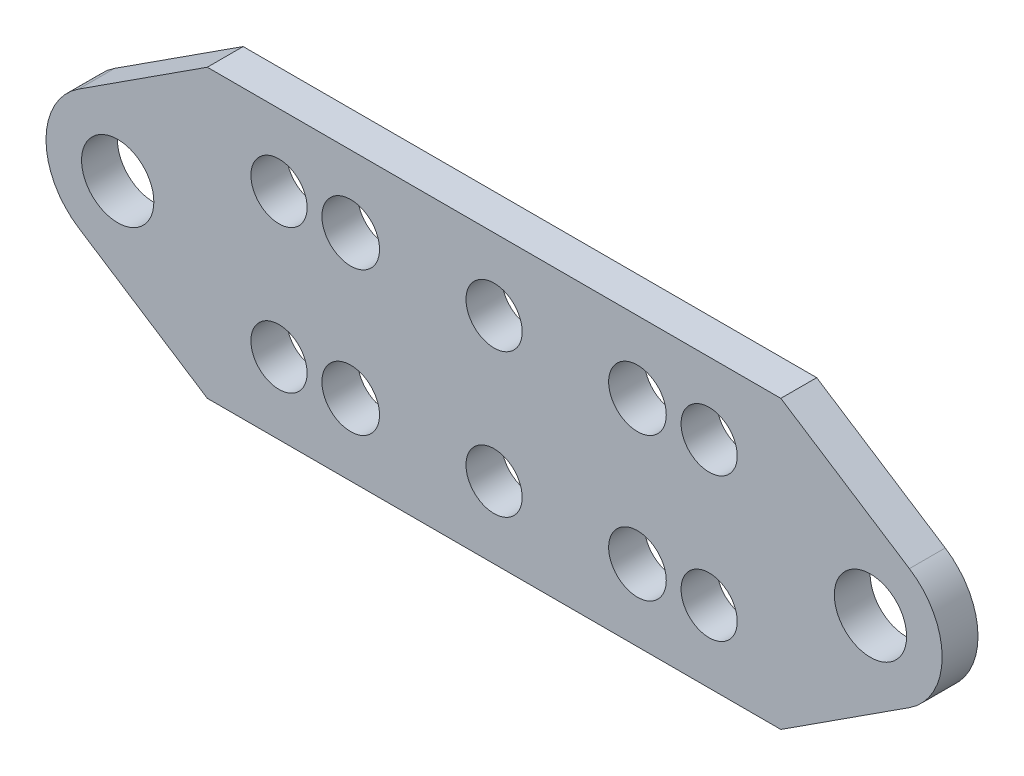
ISO-10303-21;
HEADER;
FILE_DESCRIPTION(('STEP AP214'),'2;1');
FILE_NAME('part.step','',(''),(''),'','','');
FILE_SCHEMA(('AUTOMOTIVE_DESIGN { 1 0 10303 214 1 1 1 1 }'));
ENDSEC;
DATA;
#1=APPLICATION_CONTEXT('core data for automotive mechanical design processes');
#2=APPLICATION_PROTOCOL_DEFINITION('international standard','automotive_design',2000,#1);
#3=PRODUCT_CONTEXT('',#1,'mechanical');
#4=PRODUCT('Part','Part','',(#3));
#5=PRODUCT_RELATED_PRODUCT_CATEGORY('part','',(#4));
#6=PRODUCT_DEFINITION_FORMATION('','',#4);
#7=PRODUCT_DEFINITION_CONTEXT('part definition',#1,'design');
#8=PRODUCT_DEFINITION('design','',#6,#7);
#9=PRODUCT_DEFINITION_SHAPE('','',#8);
#10=(LENGTH_UNIT() NAMED_UNIT(*) SI_UNIT(.MILLI.,.METRE.));
#11=(NAMED_UNIT(*) PLANE_ANGLE_UNIT() SI_UNIT($,.RADIAN.));
#12=(NAMED_UNIT(*) SI_UNIT($,.STERADIAN.) SOLID_ANGLE_UNIT());
#13=UNCERTAINTY_MEASURE_WITH_UNIT(LENGTH_MEASURE(1.E-05),#10,'distance_accuracy_value','');
#14=(GEOMETRIC_REPRESENTATION_CONTEXT(3) GLOBAL_UNCERTAINTY_ASSIGNED_CONTEXT((#13)) GLOBAL_UNIT_ASSIGNED_CONTEXT((#10,
#11,#12)) REPRESENTATION_CONTEXT('',''));
#15=CARTESIAN_POINT('',(0.,0.,0.));
#16=DIRECTION('',(0.,0.,1.));
#17=DIRECTION('',(1.,0.,0.));
#18=AXIS2_PLACEMENT_3D('',#15,#16,#17);
#19=CARTESIAN_POINT('',(-29.0438840042581,0.,0.));
#20=DIRECTION('',(0.,0.,1.));
#21=DIRECTION('',(1.,0.,0.));
#22=AXIS2_PLACEMENT_3D('',#19,#20,#21);
#23=PLANE('',#22);
#24=CARTESIAN_POINT('',(33.3375,0.,0.));
#25=DIRECTION('',(0.,0.,1.));
#26=DIRECTION('',(1.,0.,0.));
#27=AXIS2_PLACEMENT_3D('',#24,#25,#26);
#28=CIRCLE('',#27,3.2004);
#29=CARTESIAN_POINT('',(36.5379,0.,0.));
#30=VERTEX_POINT('',#29);
#31=EDGE_CURVE('E179',#30,#30,#28,.T.);
#32=ORIENTED_EDGE('',*,*,#31,.T.);
#33=EDGE_LOOP('',(#32));
#34=FACE_BOUND('',#33,.T.);
#35=CARTESIAN_POINT('',(-33.3375,0.,0.));
#36=DIRECTION('',(0.,0.,1.));
#37=DIRECTION('',(1.,0.,0.));
#38=AXIS2_PLACEMENT_3D('',#35,#36,#37);
#39=CIRCLE('',#38,3.2004);
#40=CARTESIAN_POINT('',(-30.1371,0.,0.));
#41=VERTEX_POINT('',#40);
#42=EDGE_CURVE('E182',#41,#41,#39,.T.);
#43=ORIENTED_EDGE('',*,*,#42,.T.);
#44=EDGE_LOOP('',(#43));
#45=FACE_BOUND('',#44,.T.);
#46=CARTESIAN_POINT('',(19.05,-6.35,0.));
#47=DIRECTION('',(0.,0.,1.));
#48=DIRECTION('',(1.,0.,0.));
#49=AXIS2_PLACEMENT_3D('',#46,#47,#48);
#50=CIRCLE('',#49,2.4892);
#51=CARTESIAN_POINT('',(21.5392,-6.35,0.));
#52=VERTEX_POINT('',#51);
#53=EDGE_CURVE('E185',#52,#52,#50,.T.);
#54=ORIENTED_EDGE('',*,*,#53,.T.);
#55=EDGE_LOOP('',(#54));
#56=FACE_BOUND('',#55,.T.);
#57=CARTESIAN_POINT('',(0.,-6.35,0.));
#58=DIRECTION('',(0.,0.,1.));
#59=DIRECTION('',(1.,0.,0.));
#60=AXIS2_PLACEMENT_3D('',#57,#58,#59);
#61=CIRCLE('',#60,2.4892);
#62=CARTESIAN_POINT('',(2.4892,-6.35,0.));
#63=VERTEX_POINT('',#62);
#64=EDGE_CURVE('E188',#63,#63,#61,.T.);
#65=ORIENTED_EDGE('',*,*,#64,.T.);
#66=EDGE_LOOP('',(#65));
#67=FACE_BOUND('',#66,.T.);
#68=CARTESIAN_POINT('',(-19.05,-6.35,0.));
#69=DIRECTION('',(0.,0.,1.));
#70=DIRECTION('',(1.,0.,0.));
#71=AXIS2_PLACEMENT_3D('',#68,#69,#70);
#72=CIRCLE('',#71,2.4892);
#73=CARTESIAN_POINT('',(-16.5608,-6.35,0.));
#74=VERTEX_POINT('',#73);
#75=EDGE_CURVE('E191',#74,#74,#72,.T.);
#76=ORIENTED_EDGE('',*,*,#75,.T.);
#77=EDGE_LOOP('',(#76));
#78=FACE_BOUND('',#77,.T.);
#79=CARTESIAN_POINT('',(-19.05,6.35,0.));
#80=DIRECTION('',(0.,0.,1.));
#81=DIRECTION('',(1.,0.,0.));
#82=AXIS2_PLACEMENT_3D('',#79,#80,#81);
#83=CIRCLE('',#82,2.4892);
#84=CARTESIAN_POINT('',(-16.5608,6.35,0.));
#85=VERTEX_POINT('',#84);
#86=EDGE_CURVE('E194',#85,#85,#83,.T.);
#87=ORIENTED_EDGE('',*,*,#86,.T.);
#88=EDGE_LOOP('',(#87));
#89=FACE_BOUND('',#88,.T.);
#90=CARTESIAN_POINT('',(0.,6.35,0.));
#91=DIRECTION('',(0.,0.,1.));
#92=DIRECTION('',(1.,0.,0.));
#93=AXIS2_PLACEMENT_3D('',#90,#91,#92);
#94=CIRCLE('',#93,2.4892);
#95=CARTESIAN_POINT('',(2.4892,6.35,0.));
#96=VERTEX_POINT('',#95);
#97=EDGE_CURVE('E197',#96,#96,#94,.T.);
#98=ORIENTED_EDGE('',*,*,#97,.T.);
#99=EDGE_LOOP('',(#98));
#100=FACE_BOUND('',#99,.T.);
#101=CARTESIAN_POINT('',(19.05,6.35,0.));
#102=DIRECTION('',(0.,0.,1.));
#103=DIRECTION('',(1.,0.,0.));
#104=AXIS2_PLACEMENT_3D('',#101,#102,#103);
#105=CIRCLE('',#104,2.4892);
#106=CARTESIAN_POINT('',(21.5392,6.35,0.));
#107=VERTEX_POINT('',#106);
#108=EDGE_CURVE('E200',#107,#107,#105,.T.);
#109=ORIENTED_EDGE('',*,*,#108,.T.);
#110=EDGE_LOOP('',(#109));
#111=FACE_BOUND('',#110,.T.);
#112=CARTESIAN_POINT('',(12.7,6.35,0.));
#113=DIRECTION('',(0.,0.,1.));
#114=DIRECTION('',(1.,0.,0.));
#115=AXIS2_PLACEMENT_3D('',#112,#113,#114);
#116=CIRCLE('',#115,2.5527);
#117=CARTESIAN_POINT('',(15.2527,6.35,0.));
#118=VERTEX_POINT('',#117);
#119=EDGE_CURVE('E203',#118,#118,#116,.T.);
#120=ORIENTED_EDGE('',*,*,#119,.T.);
#121=EDGE_LOOP('',(#120));
#122=FACE_BOUND('',#121,.T.);
#123=CARTESIAN_POINT('',(-12.7,-6.35,0.));
#124=DIRECTION('',(0.,0.,1.));
#125=DIRECTION('',(1.,0.,0.));
#126=AXIS2_PLACEMENT_3D('',#123,#124,#125);
#127=CIRCLE('',#126,2.5527);
#128=CARTESIAN_POINT('',(-10.1473,-6.35,0.));
#129=VERTEX_POINT('',#128);
#130=EDGE_CURVE('E206',#129,#129,#127,.T.);
#131=ORIENTED_EDGE('',*,*,#130,.T.);
#132=EDGE_LOOP('',(#131));
#133=FACE_BOUND('',#132,.T.);
#134=CARTESIAN_POINT('',(-12.7,6.35,0.));
#135=DIRECTION('',(0.,0.,1.));
#136=DIRECTION('',(1.,0.,0.));
#137=AXIS2_PLACEMENT_3D('',#134,#135,#136);
#138=CIRCLE('',#137,2.5527);
#139=CARTESIAN_POINT('',(-10.1473,6.35,0.));
#140=VERTEX_POINT('',#139);
#141=EDGE_CURVE('E209',#140,#140,#138,.T.);
#142=ORIENTED_EDGE('',*,*,#141,.T.);
#143=EDGE_LOOP('',(#142));
#144=FACE_BOUND('',#143,.T.);
#145=CARTESIAN_POINT('',(12.7,-6.35,0.));
#146=DIRECTION('',(0.,0.,1.));
#147=DIRECTION('',(1.,0.,0.));
#148=AXIS2_PLACEMENT_3D('',#145,#146,#147);
#149=CIRCLE('',#148,2.5527);
#150=CARTESIAN_POINT('',(15.2527,-6.35,0.));
#151=VERTEX_POINT('',#150);
#152=EDGE_CURVE('E212',#151,#151,#149,.T.);
#153=ORIENTED_EDGE('',*,*,#152,.T.);
#154=EDGE_LOOP('',(#153));
#155=FACE_BOUND('',#154,.T.);
#156=CARTESIAN_POINT('',(-33.3375,0.,0.));
#157=DIRECTION('',(0.,0.,1.));
#158=DIRECTION('',(1.,0.,0.));
#159=AXIS2_PLACEMENT_3D('',#156,#157,#158);
#160=CIRCLE('',#159,6.35);
#161=CARTESIAN_POINT('',(-36.7873358456419,5.3311474035262,0.));
#162=VERTEX_POINT('',#161);
#163=CARTESIAN_POINT('',(-36.7873358456419,-5.33114740352621,0.));
#164=VERTEX_POINT('',#163);
#165=EDGE_CURVE('E19',#162,#164,#160,.T.);
#166=ORIENTED_EDGE('',*,*,#165,.F.);
#167=DIRECTION('',(-0.83955077220885,-0.54328123553416,0.));
#168=VECTOR('',#167,1.);
#169=CARTESIAN_POINT('',(-25.4,12.7,0.));
#170=LINE('',#169,#168);
#171=CARTESIAN_POINT('',(-25.4,12.7,0.));
#172=VERTEX_POINT('',#171);
#173=EDGE_CURVE('E78',#172,#162,#170,.T.);
#174=ORIENTED_EDGE('',*,*,#173,.F.);
#175=DIRECTION('',(1.,0.,0.));
#176=VECTOR('',#175,1.);
#177=CARTESIAN_POINT('',(25.4,12.7,0.));
#178=LINE('',#177,#176);
#179=CARTESIAN_POINT('',(25.4,12.7,0.));
#180=VERTEX_POINT('',#179);
#181=EDGE_CURVE('E113',#180,#172,#178,.F.);
#182=ORIENTED_EDGE('',*,*,#181,.F.);
#183=DIRECTION('',(-0.839550772208851,0.543281235534159,0.));
#184=VECTOR('',#183,1.);
#185=CARTESIAN_POINT('',(36.7873358456419,5.33114740352621,0.));
#186=LINE('',#185,#184);
#187=CARTESIAN_POINT('',(36.7873358456419,5.33114740352621,0.));
#188=VERTEX_POINT('',#187);
#189=EDGE_CURVE('E116',#188,#180,#186,.T.);
#190=ORIENTED_EDGE('',*,*,#189,.F.);
#191=CARTESIAN_POINT('',(33.3375,0.,0.));
#192=DIRECTION('',(0.,0.,1.));
#193=DIRECTION('',(1.,0.,0.));
#194=AXIS2_PLACEMENT_3D('',#191,#192,#193);
#195=CIRCLE('',#194,6.35);
#196=CARTESIAN_POINT('',(36.7873358456419,-5.33114740352618,0.));
#197=VERTEX_POINT('',#196);
#198=EDGE_CURVE('E119',#197,#188,#195,.T.);
#199=ORIENTED_EDGE('',*,*,#198,.F.);
#200=DIRECTION('',(0.83955077220885,0.543281235534161,0.));
#201=VECTOR('',#200,1.);
#202=CARTESIAN_POINT('',(25.4,-12.7,0.));
#203=LINE('',#202,#201);
#204=CARTESIAN_POINT('',(25.4,-12.7,0.));
#205=VERTEX_POINT('',#204);
#206=EDGE_CURVE('E129',#205,#197,#203,.T.);
#207=ORIENTED_EDGE('',*,*,#206,.F.);
#208=DIRECTION('',(1.,0.,0.));
#209=VECTOR('',#208,1.);
#210=CARTESIAN_POINT('',(-25.4,-12.7,0.));
#211=LINE('',#210,#209);
#212=CARTESIAN_POINT('',(-25.4,-12.7,0.));
#213=VERTEX_POINT('',#212);
#214=EDGE_CURVE('E87',#213,#205,#211,.T.);
#215=ORIENTED_EDGE('',*,*,#214,.F.);
#216=DIRECTION('',(0.83955077220885,-0.54328123553416,0.));
#217=VECTOR('',#216,1.);
#218=CARTESIAN_POINT('',(-36.7873358456419,-5.33114740352621,0.));
#219=LINE('',#218,#217);
#220=EDGE_CURVE('E83',#164,#213,#219,.T.);
#221=ORIENTED_EDGE('',*,*,#220,.F.);
#222=EDGE_LOOP('',(#166,#174,#182,#190,#199,#207,#215,#221));
#223=FACE_BOUND('',#222,.T.);
#224=ADVANCED_FACE('F16',(#34,#45,#56,#67,#78,#89,#100,#111,#122,#133,#144,#155,#223),#23,.F.);
#225=CARTESIAN_POINT('',(-25.4,12.7,0.));
#226=DIRECTION('',(-0.54328123553416,0.83955077220885,0.));
#227=DIRECTION('',(-0.83955077220885,-0.54328123553416,0.));
#228=AXIS2_PLACEMENT_3D('',#225,#226,#227);
#229=PLANE('',#228);
#230=DIRECTION('',(-0.83955077220885,-0.543281235534159,0.));
#231=VECTOR('',#230,1.);
#232=CARTESIAN_POINT('',(-25.4,12.7,3.175));
#233=LINE('',#232,#231);
#234=CARTESIAN_POINT('',(-25.4,12.7,3.175));
#235=VERTEX_POINT('',#234);
#236=CARTESIAN_POINT('',(-36.7873358456419,5.3311474035262,3.175));
#237=VERTEX_POINT('',#236);
#238=EDGE_CURVE('E178',#235,#237,#233,.T.);
#239=ORIENTED_EDGE('',*,*,#238,.F.);
#240=DIRECTION('',(0.,0.,1.));
#241=VECTOR('',#240,1.);
#242=CARTESIAN_POINT('',(-25.4,12.7,0.));
#243=LINE('',#242,#241);
#244=EDGE_CURVE('E110',#172,#235,#243,.T.);
#245=ORIENTED_EDGE('',*,*,#244,.F.);
#246=ORIENTED_EDGE('',*,*,#173,.T.);
#247=DIRECTION('',(0.,0.,1.));
#248=VECTOR('',#247,1.);
#249=CARTESIAN_POINT('',(-36.7873358456419,5.3311474035262,0.));
#250=LINE('',#249,#248);
#251=EDGE_CURVE('E97',#237,#162,#250,.F.);
#252=ORIENTED_EDGE('',*,*,#251,.F.);
#253=EDGE_LOOP('',(#239,#245,#246,#252));
#254=FACE_BOUND('',#253,.T.);
#255=ADVANCED_FACE('F266',(#254),#229,.T.);
#256=CARTESIAN_POINT('',(-33.3375,0.,0.));
#257=DIRECTION('',(0.,0.,1.));
#258=DIRECTION('',(1.,0.,0.));
#259=AXIS2_PLACEMENT_3D('',#256,#257,#258);
#260=CYLINDRICAL_SURFACE('',#259,6.35);
#261=ORIENTED_EDGE('',*,*,#251,.T.);
#262=ORIENTED_EDGE('',*,*,#165,.T.);
#263=DIRECTION('',(0.,0.,1.));
#264=VECTOR('',#263,1.);
#265=CARTESIAN_POINT('',(-36.7873358456419,-5.33114740352621,0.));
#266=LINE('',#265,#264);
#267=CARTESIAN_POINT('',(-36.7873358456419,-5.33114740352621,3.175));
#268=VERTEX_POINT('',#267);
#269=EDGE_CURVE('E91',#268,#164,#266,.F.);
#270=ORIENTED_EDGE('',*,*,#269,.F.);
#271=CARTESIAN_POINT('',(-33.3375,0.,3.175));
#272=DIRECTION('',(0.,0.,1.));
#273=DIRECTION('',(1.,0.,0.));
#274=AXIS2_PLACEMENT_3D('',#271,#272,#273);
#275=CIRCLE('',#274,6.35);
#276=EDGE_CURVE('E176',#237,#268,#275,.T.);
#277=ORIENTED_EDGE('',*,*,#276,.F.);
#278=EDGE_LOOP('',(#261,#262,#270,#277));
#279=FACE_BOUND('',#278,.T.);
#280=ADVANCED_FACE('F94',(#279),#260,.T.);
#281=CARTESIAN_POINT('',(-36.7873358456419,-5.33114740352621,0.));
#282=DIRECTION('',(-0.54328123553416,-0.83955077220885,0.));
#283=DIRECTION('',(0.83955077220885,-0.54328123553416,0.));
#284=AXIS2_PLACEMENT_3D('',#281,#282,#283);
#285=PLANE('',#284);
#286=DIRECTION('',(0.83955077220885,-0.543281235534159,0.));
#287=VECTOR('',#286,1.);
#288=CARTESIAN_POINT('',(-36.7873358456419,-5.33114740352621,3.175));
#289=LINE('',#288,#287);
#290=CARTESIAN_POINT('',(-25.4,-12.7,3.175));
#291=VERTEX_POINT('',#290);
#292=EDGE_CURVE('E100',#268,#291,#289,.T.);
#293=ORIENTED_EDGE('',*,*,#292,.F.);
#294=ORIENTED_EDGE('',*,*,#269,.T.);
#295=ORIENTED_EDGE('',*,*,#220,.T.);
#296=DIRECTION('',(0.,0.,-1.));
#297=VECTOR('',#296,1.);
#298=CARTESIAN_POINT('',(-25.4,-12.7,0.));
#299=LINE('',#298,#297);
#300=EDGE_CURVE('E103',#291,#213,#299,.T.);
#301=ORIENTED_EDGE('',*,*,#300,.F.);
#302=EDGE_LOOP('',(#293,#294,#295,#301));
#303=FACE_BOUND('',#302,.T.);
#304=ADVANCED_FACE('F98',(#303),#285,.T.);
#305=CARTESIAN_POINT('',(-25.4,-12.7,0.));
#306=DIRECTION('',(0.,-1.,0.));
#307=DIRECTION('',(0.,0.,-1.));
#308=AXIS2_PLACEMENT_3D('',#305,#306,#307);
#309=PLANE('',#308);
#310=DIRECTION('',(1.,0.,0.));
#311=VECTOR('',#310,1.);
#312=CARTESIAN_POINT('',(-29.0438840042581,-12.7,3.175));
#313=LINE('',#312,#311);
#314=CARTESIAN_POINT('',(25.4,-12.7,3.175));
#315=VERTEX_POINT('',#314);
#316=EDGE_CURVE('E230',#291,#315,#313,.T.);
#317=ORIENTED_EDGE('',*,*,#316,.F.);
#318=ORIENTED_EDGE('',*,*,#300,.T.);
#319=ORIENTED_EDGE('',*,*,#214,.T.);
#320=DIRECTION('',(0.,0.,1.));
#321=VECTOR('',#320,1.);
#322=CARTESIAN_POINT('',(25.4,-12.7,0.));
#323=LINE('',#322,#321);
#324=EDGE_CURVE('E131',#315,#205,#323,.F.);
#325=ORIENTED_EDGE('',*,*,#324,.F.);
#326=EDGE_LOOP('',(#317,#318,#319,#325));
#327=FACE_BOUND('',#326,.T.);
#328=ADVANCED_FACE('F236',(#327),#309,.T.);
#329=CARTESIAN_POINT('',(25.4,-12.7,0.));
#330=DIRECTION('',(0.543281235534161,-0.83955077220885,0.));
#331=DIRECTION('',(0.83955077220885,0.543281235534161,0.));
#332=AXIS2_PLACEMENT_3D('',#329,#330,#331);
#333=PLANE('',#332);
#334=DIRECTION('',(0.83955077220885,0.543281235534161,0.));
#335=VECTOR('',#334,1.);
#336=CARTESIAN_POINT('',(25.4,-12.7,3.175));
#337=LINE('',#336,#335);
#338=CARTESIAN_POINT('',(36.7873358456419,-5.33114740352618,3.175));
#339=VERTEX_POINT('',#338);
#340=EDGE_CURVE('E175',#315,#339,#337,.T.);
#341=ORIENTED_EDGE('',*,*,#340,.F.);
#342=ORIENTED_EDGE('',*,*,#324,.T.);
#343=ORIENTED_EDGE('',*,*,#206,.T.);
#344=DIRECTION('',(0.,0.,1.));
#345=VECTOR('',#344,1.);
#346=CARTESIAN_POINT('',(36.7873358456419,-5.33114740352619,0.));
#347=LINE('',#346,#345);
#348=EDGE_CURVE('E215',#339,#197,#347,.F.);
#349=ORIENTED_EDGE('',*,*,#348,.F.);
#350=EDGE_LOOP('',(#341,#342,#343,#349));
#351=FACE_BOUND('',#350,.T.);
#352=ADVANCED_FACE('F263',(#351),#333,.T.);
#353=CARTESIAN_POINT('',(33.3375,0.,0.));
#354=DIRECTION('',(0.,0.,1.));
#355=DIRECTION('',(1.,0.,0.));
#356=AXIS2_PLACEMENT_3D('',#353,#354,#355);
#357=CYLINDRICAL_SURFACE('',#356,6.35);
#358=ORIENTED_EDGE('',*,*,#348,.T.);
#359=ORIENTED_EDGE('',*,*,#198,.T.);
#360=DIRECTION('',(0.,0.,1.));
#361=VECTOR('',#360,1.);
#362=CARTESIAN_POINT('',(36.7873358456419,5.33114740352621,0.));
#363=LINE('',#362,#361);
#364=CARTESIAN_POINT('',(36.7873358456419,5.33114740352621,3.175));
#365=VERTEX_POINT('',#364);
#366=EDGE_CURVE('E118',#365,#188,#363,.F.);
#367=ORIENTED_EDGE('',*,*,#366,.F.);
#368=CARTESIAN_POINT('',(33.3375,0.,3.175));
#369=DIRECTION('',(0.,0.,1.));
#370=DIRECTION('',(1.,0.,0.));
#371=AXIS2_PLACEMENT_3D('',#368,#369,#370);
#372=CIRCLE('',#371,6.35);
#373=EDGE_CURVE('E171',#339,#365,#372,.T.);
#374=ORIENTED_EDGE('',*,*,#373,.F.);
#375=EDGE_LOOP('',(#358,#359,#367,#374));
#376=FACE_BOUND('',#375,.T.);
#377=ADVANCED_FACE('F264',(#376),#357,.T.);
#378=CARTESIAN_POINT('',(36.7873358456419,5.33114740352621,0.));
#379=DIRECTION('',(0.543281235534159,0.839550772208851,0.));
#380=DIRECTION('',(-0.839550772208851,0.543281235534159,0.));
#381=AXIS2_PLACEMENT_3D('',#378,#379,#380);
#382=PLANE('',#381);
#383=DIRECTION('',(-0.83955077220885,0.54328123553416,0.));
#384=VECTOR('',#383,1.);
#385=CARTESIAN_POINT('',(36.7873358456419,5.33114740352621,3.175));
#386=LINE('',#385,#384);
#387=CARTESIAN_POINT('',(25.4,12.7,3.175));
#388=VERTEX_POINT('',#387);
#389=EDGE_CURVE('E174',#365,#388,#386,.T.);
#390=ORIENTED_EDGE('',*,*,#389,.F.);
#391=ORIENTED_EDGE('',*,*,#366,.T.);
#392=ORIENTED_EDGE('',*,*,#189,.T.);
#393=DIRECTION('',(0.,0.,1.));
#394=VECTOR('',#393,1.);
#395=CARTESIAN_POINT('',(25.4,12.7,0.));
#396=LINE('',#395,#394);
#397=EDGE_CURVE('E34',#388,#180,#396,.F.);
#398=ORIENTED_EDGE('',*,*,#397,.F.);
#399=EDGE_LOOP('',(#390,#391,#392,#398));
#400=FACE_BOUND('',#399,.T.);
#401=ADVANCED_FACE('F265',(#400),#382,.T.);
#402=CARTESIAN_POINT('',(25.4,12.7,0.));
#403=DIRECTION('',(0.,1.,0.));
#404=DIRECTION('',(0.,0.,1.));
#405=AXIS2_PLACEMENT_3D('',#402,#403,#404);
#406=PLANE('',#405);
#407=DIRECTION('',(1.,0.,0.));
#408=VECTOR('',#407,1.);
#409=CARTESIAN_POINT('',(-29.0438840042581,12.7,3.175));
#410=LINE('',#409,#408);
#411=EDGE_CURVE('E170',#388,#235,#410,.F.);
#412=ORIENTED_EDGE('',*,*,#411,.F.);
#413=ORIENTED_EDGE('',*,*,#397,.T.);
#414=ORIENTED_EDGE('',*,*,#181,.T.);
#415=ORIENTED_EDGE('',*,*,#244,.T.);
#416=EDGE_LOOP('',(#412,#413,#414,#415));
#417=FACE_BOUND('',#416,.T.);
#418=ADVANCED_FACE('F258',(#417),#406,.T.);
#419=CARTESIAN_POINT('',(12.7,-6.35,-80.2254271571794));
#420=DIRECTION('',(0.,0.,1.));
#421=DIRECTION('',(1.,0.,0.));
#422=AXIS2_PLACEMENT_3D('',#419,#420,#421);
#423=CYLINDRICAL_SURFACE('',#422,2.5527);
#424=CARTESIAN_POINT('',(12.7,-6.35,3.175));
#425=DIRECTION('',(0.,0.,1.));
#426=DIRECTION('',(1.,0.,0.));
#427=AXIS2_PLACEMENT_3D('',#424,#425,#426);
#428=CIRCLE('',#427,2.5527);
#429=CARTESIAN_POINT('',(15.2527,-6.35,3.175));
#430=VERTEX_POINT('',#429);
#431=EDGE_CURVE('E167',#430,#430,#428,.F.);
#432=ORIENTED_EDGE('',*,*,#431,.F.);
#433=EDGE_LOOP('',(#432));
#434=FACE_BOUND('',#433,.T.);
#435=ORIENTED_EDGE('',*,*,#152,.F.);
#436=EDGE_LOOP('',(#435));
#437=FACE_BOUND('',#436,.T.);
#438=ADVANCED_FACE('F325',(#434,#437),#423,.F.);
#439=CARTESIAN_POINT('',(-12.7,6.35,-80.2254271571794));
#440=DIRECTION('',(0.,0.,1.));
#441=DIRECTION('',(1.,0.,0.));
#442=AXIS2_PLACEMENT_3D('',#439,#440,#441);
#443=CYLINDRICAL_SURFACE('',#442,2.5527);
#444=CARTESIAN_POINT('',(-12.7,6.35,3.175));
#445=DIRECTION('',(0.,0.,1.));
#446=DIRECTION('',(1.,0.,0.));
#447=AXIS2_PLACEMENT_3D('',#444,#445,#446);
#448=CIRCLE('',#447,2.5527);
#449=CARTESIAN_POINT('',(-10.1473,6.35,3.175));
#450=VERTEX_POINT('',#449);
#451=EDGE_CURVE('E164',#450,#450,#448,.F.);
#452=ORIENTED_EDGE('',*,*,#451,.F.);
#453=EDGE_LOOP('',(#452));
#454=FACE_BOUND('',#453,.T.);
#455=ORIENTED_EDGE('',*,*,#141,.F.);
#456=EDGE_LOOP('',(#455));
#457=FACE_BOUND('',#456,.T.);
#458=ADVANCED_FACE('F321',(#454,#457),#443,.F.);
#459=CARTESIAN_POINT('',(-12.7,-6.35,-80.2254271571794));
#460=DIRECTION('',(0.,0.,1.));
#461=DIRECTION('',(1.,0.,0.));
#462=AXIS2_PLACEMENT_3D('',#459,#460,#461);
#463=CYLINDRICAL_SURFACE('',#462,2.5527);
#464=CARTESIAN_POINT('',(-12.7,-6.35,3.175));
#465=DIRECTION('',(0.,0.,1.));
#466=DIRECTION('',(1.,0.,0.));
#467=AXIS2_PLACEMENT_3D('',#464,#465,#466);
#468=CIRCLE('',#467,2.5527);
#469=CARTESIAN_POINT('',(-10.1473,-6.35,3.175));
#470=VERTEX_POINT('',#469);
#471=EDGE_CURVE('E161',#470,#470,#468,.F.);
#472=ORIENTED_EDGE('',*,*,#471,.F.);
#473=EDGE_LOOP('',(#472));
#474=FACE_BOUND('',#473,.T.);
#475=ORIENTED_EDGE('',*,*,#130,.F.);
#476=EDGE_LOOP('',(#475));
#477=FACE_BOUND('',#476,.T.);
#478=ADVANCED_FACE('F317',(#474,#477),#463,.F.);
#479=CARTESIAN_POINT('',(12.7,6.35,-80.2254271571794));
#480=DIRECTION('',(0.,0.,1.));
#481=DIRECTION('',(1.,0.,0.));
#482=AXIS2_PLACEMENT_3D('',#479,#480,#481);
#483=CYLINDRICAL_SURFACE('',#482,2.5527);
#484=CARTESIAN_POINT('',(12.7,6.35,3.175));
#485=DIRECTION('',(0.,0.,1.));
#486=DIRECTION('',(1.,0.,0.));
#487=AXIS2_PLACEMENT_3D('',#484,#485,#486);
#488=CIRCLE('',#487,2.5527);
#489=CARTESIAN_POINT('',(15.2527,6.35,3.175));
#490=VERTEX_POINT('',#489);
#491=EDGE_CURVE('E158',#490,#490,#488,.F.);
#492=ORIENTED_EDGE('',*,*,#491,.F.);
#493=EDGE_LOOP('',(#492));
#494=FACE_BOUND('',#493,.T.);
#495=ORIENTED_EDGE('',*,*,#119,.F.);
#496=EDGE_LOOP('',(#495));
#497=FACE_BOUND('',#496,.T.);
#498=ADVANCED_FACE('F313',(#494,#497),#483,.F.);
#499=CARTESIAN_POINT('',(19.05,6.35,-80.2254271571794));
#500=DIRECTION('',(0.,0.,1.));
#501=DIRECTION('',(1.,0.,0.));
#502=AXIS2_PLACEMENT_3D('',#499,#500,#501);
#503=CYLINDRICAL_SURFACE('',#502,2.4892);
#504=CARTESIAN_POINT('',(19.05,6.35,3.175));
#505=DIRECTION('',(0.,0.,1.));
#506=DIRECTION('',(1.,0.,0.));
#507=AXIS2_PLACEMENT_3D('',#504,#505,#506);
#508=CIRCLE('',#507,2.4892);
#509=CARTESIAN_POINT('',(21.5392,6.35,3.175));
#510=VERTEX_POINT('',#509);
#511=EDGE_CURVE('E155',#510,#510,#508,.F.);
#512=ORIENTED_EDGE('',*,*,#511,.F.);
#513=EDGE_LOOP('',(#512));
#514=FACE_BOUND('',#513,.T.);
#515=ORIENTED_EDGE('',*,*,#108,.F.);
#516=EDGE_LOOP('',(#515));
#517=FACE_BOUND('',#516,.T.);
#518=ADVANCED_FACE('F309',(#514,#517),#503,.F.);
#519=CARTESIAN_POINT('',(0.,6.35,-80.2254271571794));
#520=DIRECTION('',(0.,0.,1.));
#521=DIRECTION('',(1.,0.,0.));
#522=AXIS2_PLACEMENT_3D('',#519,#520,#521);
#523=CYLINDRICAL_SURFACE('',#522,2.4892);
#524=CARTESIAN_POINT('',(0.,6.35,3.175));
#525=DIRECTION('',(0.,0.,1.));
#526=DIRECTION('',(1.,0.,0.));
#527=AXIS2_PLACEMENT_3D('',#524,#525,#526);
#528=CIRCLE('',#527,2.4892);
#529=CARTESIAN_POINT('',(2.4892,6.35,3.175));
#530=VERTEX_POINT('',#529);
#531=EDGE_CURVE('E152',#530,#530,#528,.F.);
#532=ORIENTED_EDGE('',*,*,#531,.F.);
#533=EDGE_LOOP('',(#532));
#534=FACE_BOUND('',#533,.T.);
#535=ORIENTED_EDGE('',*,*,#97,.F.);
#536=EDGE_LOOP('',(#535));
#537=FACE_BOUND('',#536,.T.);
#538=ADVANCED_FACE('F305',(#534,#537),#523,.F.);
#539=CARTESIAN_POINT('',(-19.05,6.35,-80.2254271571794));
#540=DIRECTION('',(0.,0.,1.));
#541=DIRECTION('',(1.,0.,0.));
#542=AXIS2_PLACEMENT_3D('',#539,#540,#541);
#543=CYLINDRICAL_SURFACE('',#542,2.4892);
#544=CARTESIAN_POINT('',(-19.05,6.35,3.175));
#545=DIRECTION('',(0.,0.,1.));
#546=DIRECTION('',(1.,0.,0.));
#547=AXIS2_PLACEMENT_3D('',#544,#545,#546);
#548=CIRCLE('',#547,2.4892);
#549=CARTESIAN_POINT('',(-16.5608,6.35,3.175));
#550=VERTEX_POINT('',#549);
#551=EDGE_CURVE('E149',#550,#550,#548,.F.);
#552=ORIENTED_EDGE('',*,*,#551,.F.);
#553=EDGE_LOOP('',(#552));
#554=FACE_BOUND('',#553,.T.);
#555=ORIENTED_EDGE('',*,*,#86,.F.);
#556=EDGE_LOOP('',(#555));
#557=FACE_BOUND('',#556,.T.);
#558=ADVANCED_FACE('F301',(#554,#557),#543,.F.);
#559=CARTESIAN_POINT('',(-19.05,-6.35,-80.2254271571794));
#560=DIRECTION('',(0.,0.,1.));
#561=DIRECTION('',(1.,0.,0.));
#562=AXIS2_PLACEMENT_3D('',#559,#560,#561);
#563=CYLINDRICAL_SURFACE('',#562,2.4892);
#564=CARTESIAN_POINT('',(-19.05,-6.35,3.175));
#565=DIRECTION('',(0.,0.,1.));
#566=DIRECTION('',(1.,0.,0.));
#567=AXIS2_PLACEMENT_3D('',#564,#565,#566);
#568=CIRCLE('',#567,2.4892);
#569=CARTESIAN_POINT('',(-16.5608,-6.35,3.175));
#570=VERTEX_POINT('',#569);
#571=EDGE_CURVE('E146',#570,#570,#568,.F.);
#572=ORIENTED_EDGE('',*,*,#571,.F.);
#573=EDGE_LOOP('',(#572));
#574=FACE_BOUND('',#573,.T.);
#575=ORIENTED_EDGE('',*,*,#75,.F.);
#576=EDGE_LOOP('',(#575));
#577=FACE_BOUND('',#576,.T.);
#578=ADVANCED_FACE('F297',(#574,#577),#563,.F.);
#579=CARTESIAN_POINT('',(0.,-6.35,-80.2254271571794));
#580=DIRECTION('',(0.,0.,1.));
#581=DIRECTION('',(1.,0.,0.));
#582=AXIS2_PLACEMENT_3D('',#579,#580,#581);
#583=CYLINDRICAL_SURFACE('',#582,2.4892);
#584=CARTESIAN_POINT('',(0.,-6.35,3.175));
#585=DIRECTION('',(0.,0.,1.));
#586=DIRECTION('',(1.,0.,0.));
#587=AXIS2_PLACEMENT_3D('',#584,#585,#586);
#588=CIRCLE('',#587,2.4892);
#589=CARTESIAN_POINT('',(2.4892,-6.35,3.175));
#590=VERTEX_POINT('',#589);
#591=EDGE_CURVE('E143',#590,#590,#588,.F.);
#592=ORIENTED_EDGE('',*,*,#591,.F.);
#593=EDGE_LOOP('',(#592));
#594=FACE_BOUND('',#593,.T.);
#595=ORIENTED_EDGE('',*,*,#64,.F.);
#596=EDGE_LOOP('',(#595));
#597=FACE_BOUND('',#596,.T.);
#598=ADVANCED_FACE('F293',(#594,#597),#583,.F.);
#599=CARTESIAN_POINT('',(19.05,-6.35,-80.2254271571794));
#600=DIRECTION('',(0.,0.,1.));
#601=DIRECTION('',(1.,0.,0.));
#602=AXIS2_PLACEMENT_3D('',#599,#600,#601);
#603=CYLINDRICAL_SURFACE('',#602,2.4892);
#604=CARTESIAN_POINT('',(19.05,-6.35,3.175));
#605=DIRECTION('',(0.,0.,1.));
#606=DIRECTION('',(1.,0.,0.));
#607=AXIS2_PLACEMENT_3D('',#604,#605,#606);
#608=CIRCLE('',#607,2.4892);
#609=CARTESIAN_POINT('',(21.5392,-6.35,3.175));
#610=VERTEX_POINT('',#609);
#611=EDGE_CURVE('E140',#610,#610,#608,.F.);
#612=ORIENTED_EDGE('',*,*,#611,.F.);
#613=EDGE_LOOP('',(#612));
#614=FACE_BOUND('',#613,.T.);
#615=ORIENTED_EDGE('',*,*,#53,.F.);
#616=EDGE_LOOP('',(#615));
#617=FACE_BOUND('',#616,.T.);
#618=ADVANCED_FACE('F289',(#614,#617),#603,.F.);
#619=CARTESIAN_POINT('',(-33.3375,0.,-80.2254271571794));
#620=DIRECTION('',(0.,0.,1.));
#621=DIRECTION('',(1.,0.,0.));
#622=AXIS2_PLACEMENT_3D('',#619,#620,#621);
#623=CYLINDRICAL_SURFACE('',#622,3.2004);
#624=CARTESIAN_POINT('',(-33.3375,0.,3.175));
#625=DIRECTION('',(0.,0.,1.));
#626=DIRECTION('',(1.,0.,0.));
#627=AXIS2_PLACEMENT_3D('',#624,#625,#626);
#628=CIRCLE('',#627,3.2004);
#629=CARTESIAN_POINT('',(-30.1371,0.,3.175));
#630=VERTEX_POINT('',#629);
#631=EDGE_CURVE('E25',#630,#630,#628,.F.);
#632=ORIENTED_EDGE('',*,*,#631,.F.);
#633=EDGE_LOOP('',(#632));
#634=FACE_BOUND('',#633,.T.);
#635=ORIENTED_EDGE('',*,*,#42,.F.);
#636=EDGE_LOOP('',(#635));
#637=FACE_BOUND('',#636,.T.);
#638=ADVANCED_FACE('F282',(#634,#637),#623,.F.);
#639=CARTESIAN_POINT('',(33.3375,0.,-80.2254271571794));
#640=DIRECTION('',(0.,0.,1.));
#641=DIRECTION('',(1.,0.,0.));
#642=AXIS2_PLACEMENT_3D('',#639,#640,#641);
#643=CYLINDRICAL_SURFACE('',#642,3.2004);
#644=CARTESIAN_POINT('',(33.3375,0.,3.175));
#645=DIRECTION('',(0.,0.,1.));
#646=DIRECTION('',(1.,0.,0.));
#647=AXIS2_PLACEMENT_3D('',#644,#645,#646);
#648=CIRCLE('',#647,3.2004);
#649=CARTESIAN_POINT('',(36.5379,0.,3.175));
#650=VERTEX_POINT('',#649);
#651=EDGE_CURVE('E10',#650,#650,#648,.F.);
#652=ORIENTED_EDGE('',*,*,#651,.F.);
#653=EDGE_LOOP('',(#652));
#654=FACE_BOUND('',#653,.T.);
#655=ORIENTED_EDGE('',*,*,#31,.F.);
#656=EDGE_LOOP('',(#655));
#657=FACE_BOUND('',#656,.T.);
#658=ADVANCED_FACE('F276',(#654,#657),#643,.F.);
#659=CARTESIAN_POINT('',(-29.0438840042581,0.,3.175));
#660=DIRECTION('',(0.,0.,1.));
#661=DIRECTION('',(1.,0.,0.));
#662=AXIS2_PLACEMENT_3D('',#659,#660,#661);
#663=PLANE('',#662);
#664=ORIENTED_EDGE('',*,*,#651,.T.);
#665=EDGE_LOOP('',(#664));
#666=FACE_BOUND('',#665,.T.);
#667=ORIENTED_EDGE('',*,*,#631,.T.);
#668=EDGE_LOOP('',(#667));
#669=FACE_BOUND('',#668,.T.);
#670=ORIENTED_EDGE('',*,*,#611,.T.);
#671=EDGE_LOOP('',(#670));
#672=FACE_BOUND('',#671,.T.);
#673=ORIENTED_EDGE('',*,*,#591,.T.);
#674=EDGE_LOOP('',(#673));
#675=FACE_BOUND('',#674,.T.);
#676=ORIENTED_EDGE('',*,*,#571,.T.);
#677=EDGE_LOOP('',(#676));
#678=FACE_BOUND('',#677,.T.);
#679=ORIENTED_EDGE('',*,*,#551,.T.);
#680=EDGE_LOOP('',(#679));
#681=FACE_BOUND('',#680,.T.);
#682=ORIENTED_EDGE('',*,*,#531,.T.);
#683=EDGE_LOOP('',(#682));
#684=FACE_BOUND('',#683,.T.);
#685=ORIENTED_EDGE('',*,*,#511,.T.);
#686=EDGE_LOOP('',(#685));
#687=FACE_BOUND('',#686,.T.);
#688=ORIENTED_EDGE('',*,*,#491,.T.);
#689=EDGE_LOOP('',(#688));
#690=FACE_BOUND('',#689,.T.);
#691=ORIENTED_EDGE('',*,*,#471,.T.);
#692=EDGE_LOOP('',(#691));
#693=FACE_BOUND('',#692,.T.);
#694=ORIENTED_EDGE('',*,*,#451,.T.);
#695=EDGE_LOOP('',(#694));
#696=FACE_BOUND('',#695,.T.);
#697=ORIENTED_EDGE('',*,*,#431,.T.);
#698=EDGE_LOOP('',(#697));
#699=FACE_BOUND('',#698,.T.);
#700=ORIENTED_EDGE('',*,*,#389,.T.);
#701=ORIENTED_EDGE('',*,*,#411,.T.);
#702=ORIENTED_EDGE('',*,*,#238,.T.);
#703=ORIENTED_EDGE('',*,*,#276,.T.);
#704=ORIENTED_EDGE('',*,*,#292,.T.);
#705=ORIENTED_EDGE('',*,*,#316,.T.);
#706=ORIENTED_EDGE('',*,*,#340,.T.);
#707=ORIENTED_EDGE('',*,*,#373,.T.);
#708=EDGE_LOOP('',(#700,#701,#702,#703,#704,#705,#706,#707));
#709=FACE_BOUND('',#708,.T.);
#710=ADVANCED_FACE('F241',(#666,#669,#672,#675,#678,#681,#684,#687,#690,#693,#696,#699,#709),
#663,.T.);
#711=CLOSED_SHELL('',(#224,#255,#280,#304,#328,#352,#377,#401,#418,#438,#458,#478,#498,#518,
#538,#558,#578,#598,#618,#638,#658,#710));
#712=MANIFOLD_SOLID_BREP('B1',#711);
#713=ADVANCED_BREP_SHAPE_REPRESENTATION('',(#18,#712),#14);
#714=SHAPE_DEFINITION_REPRESENTATION(#9,#713);
ENDSEC;
END-ISO-10303-21;
